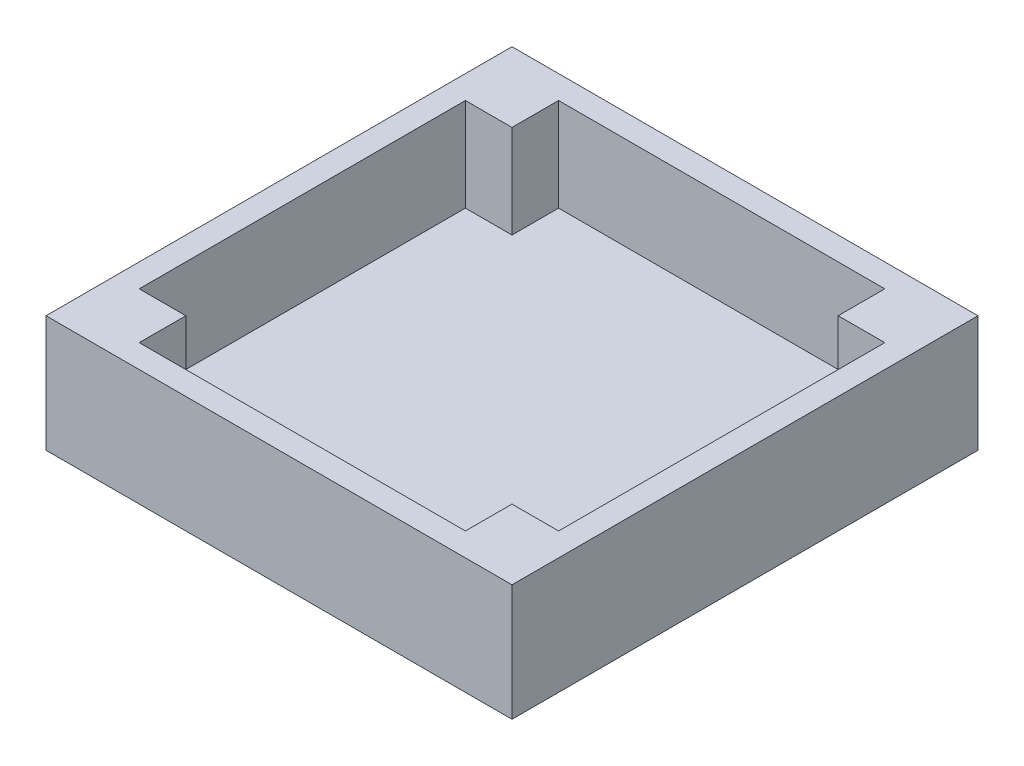
ISO-10303-21;
HEADER;
FILE_DESCRIPTION(('STEP AP214'),'2;1');
FILE_NAME('part.step','',(''),(''),'','','');
FILE_SCHEMA(('AUTOMOTIVE_DESIGN { 1 0 10303 214 1 1 1 1 }'));
ENDSEC;
DATA;
#1=APPLICATION_CONTEXT('core data for automotive mechanical design processes');
#2=APPLICATION_PROTOCOL_DEFINITION('international standard','automotive_design',2000,#1);
#3=PRODUCT_CONTEXT('',#1,'mechanical');
#4=PRODUCT('Part','Part','',(#3));
#5=PRODUCT_RELATED_PRODUCT_CATEGORY('part','',(#4));
#6=PRODUCT_DEFINITION_FORMATION('','',#4);
#7=PRODUCT_DEFINITION_CONTEXT('part definition',#1,'design');
#8=PRODUCT_DEFINITION('design','',#6,#7);
#9=PRODUCT_DEFINITION_SHAPE('','',#8);
#10=(LENGTH_UNIT() NAMED_UNIT(*) SI_UNIT(.MILLI.,.METRE.));
#11=(NAMED_UNIT(*) PLANE_ANGLE_UNIT() SI_UNIT($,.RADIAN.));
#12=(NAMED_UNIT(*) SI_UNIT($,.STERADIAN.) SOLID_ANGLE_UNIT());
#13=UNCERTAINTY_MEASURE_WITH_UNIT(LENGTH_MEASURE(1.E-05),#10,'distance_accuracy_value','');
#14=(GEOMETRIC_REPRESENTATION_CONTEXT(3) GLOBAL_UNCERTAINTY_ASSIGNED_CONTEXT((#13)) GLOBAL_UNIT_ASSIGNED_CONTEXT((#10,
#11,#12)) REPRESENTATION_CONTEXT('',''));
#15=CARTESIAN_POINT('',(0.,0.,0.));
#16=DIRECTION('',(0.,0.,1.));
#17=DIRECTION('',(1.,0.,0.));
#18=AXIS2_PLACEMENT_3D('',#15,#16,#17);
#19=CARTESIAN_POINT('',(0.,3.,0.));
#20=DIRECTION('',(0.,-1.,0.));
#21=DIRECTION('',(0.,0.,-1.));
#22=AXIS2_PLACEMENT_3D('',#19,#20,#21);
#23=PLANE('',#22);
#24=DIRECTION('',(-1.,0.,0.));
#25=VECTOR('',#24,1.);
#26=CARTESIAN_POINT('',(21.,3.,21.));
#27=LINE('',#26,#25);
#28=CARTESIAN_POINT('',(27.,3.,21.));
#29=VERTEX_POINT('',#28);
#30=CARTESIAN_POINT('',(21.,3.,21.));
#31=VERTEX_POINT('',#30);
#32=EDGE_CURVE('E57',#29,#31,#27,.T.);
#33=ORIENTED_EDGE('',*,*,#32,.F.);
#34=DIRECTION('',(0.,0.,-1.));
#35=VECTOR('',#34,1.);
#36=CARTESIAN_POINT('',(27.,3.,0.));
#37=LINE('',#36,#35);
#38=CARTESIAN_POINT('',(27.,3.,-21.));
#39=VERTEX_POINT('',#38);
#40=EDGE_CURVE('E225',#29,#39,#37,.T.);
#41=ORIENTED_EDGE('',*,*,#40,.T.);
#42=DIRECTION('',(1.,0.,0.));
#43=VECTOR('',#42,1.);
#44=CARTESIAN_POINT('',(21.,3.,-21.));
#45=LINE('',#44,#43);
#46=CARTESIAN_POINT('',(21.,3.,-21.));
#47=VERTEX_POINT('',#46);
#48=EDGE_CURVE('E187',#47,#39,#45,.T.);
#49=ORIENTED_EDGE('',*,*,#48,.F.);
#50=DIRECTION('',(0.,0.,1.));
#51=VECTOR('',#50,1.);
#52=CARTESIAN_POINT('',(21.,3.,-27.));
#53=LINE('',#52,#51);
#54=CARTESIAN_POINT('',(21.,3.,-27.));
#55=VERTEX_POINT('',#54);
#56=EDGE_CURVE('E167',#55,#47,#53,.T.);
#57=ORIENTED_EDGE('',*,*,#56,.F.);
#58=DIRECTION('',(-1.,0.,0.));
#59=VECTOR('',#58,1.);
#60=CARTESIAN_POINT('',(0.,3.,-27.));
#61=LINE('',#60,#59);
#62=CARTESIAN_POINT('',(-21.,3.,-27.));
#63=VERTEX_POINT('',#62);
#64=EDGE_CURVE('E240',#55,#63,#61,.T.);
#65=ORIENTED_EDGE('',*,*,#64,.T.);
#66=DIRECTION('',(0.,0.,-1.));
#67=VECTOR('',#66,1.);
#68=CARTESIAN_POINT('',(-21.,3.,-27.));
#69=LINE('',#68,#67);
#70=CARTESIAN_POINT('',(-21.,3.,-21.));
#71=VERTEX_POINT('',#70);
#72=EDGE_CURVE('E228',#71,#63,#69,.T.);
#73=ORIENTED_EDGE('',*,*,#72,.F.);
#74=DIRECTION('',(1.,0.,0.));
#75=VECTOR('',#74,1.);
#76=CARTESIAN_POINT('',(-27.,3.,-21.));
#77=LINE('',#76,#75);
#78=CARTESIAN_POINT('',(-27.,3.,-21.));
#79=VERTEX_POINT('',#78);
#80=EDGE_CURVE('E201',#79,#71,#77,.T.);
#81=ORIENTED_EDGE('',*,*,#80,.F.);
#82=DIRECTION('',(0.,0.,1.));
#83=VECTOR('',#82,1.);
#84=CARTESIAN_POINT('',(-27.,3.,0.));
#85=LINE('',#84,#83);
#86=CARTESIAN_POINT('',(-27.,3.,21.));
#87=VERTEX_POINT('',#86);
#88=EDGE_CURVE('E242',#79,#87,#85,.T.);
#89=ORIENTED_EDGE('',*,*,#88,.T.);
#90=DIRECTION('',(-1.,0.,0.));
#91=VECTOR('',#90,1.);
#92=CARTESIAN_POINT('',(-27.,3.,21.));
#93=LINE('',#92,#91);
#94=CARTESIAN_POINT('',(-21.,3.,21.));
#95=VERTEX_POINT('',#94);
#96=EDGE_CURVE('E205',#95,#87,#93,.T.);
#97=ORIENTED_EDGE('',*,*,#96,.F.);
#98=DIRECTION('',(0.,0.,-1.));
#99=VECTOR('',#98,1.);
#100=CARTESIAN_POINT('',(-21.,3.,21.));
#101=LINE('',#100,#99);
#102=CARTESIAN_POINT('',(-21.,3.,27.));
#103=VERTEX_POINT('',#102);
#104=EDGE_CURVE('E184',#103,#95,#101,.T.);
#105=ORIENTED_EDGE('',*,*,#104,.F.);
#106=DIRECTION('',(1.,0.,0.));
#107=VECTOR('',#106,1.);
#108=CARTESIAN_POINT('',(0.,3.,27.));
#109=LINE('',#108,#107);
#110=CARTESIAN_POINT('',(21.,3.,27.));
#111=VERTEX_POINT('',#110);
#112=EDGE_CURVE('E245',#103,#111,#109,.T.);
#113=ORIENTED_EDGE('',*,*,#112,.T.);
#114=DIRECTION('',(0.,0.,1.));
#115=VECTOR('',#114,1.);
#116=CARTESIAN_POINT('',(21.,3.,21.));
#117=LINE('',#116,#115);
#118=EDGE_CURVE('E52',#31,#111,#117,.T.);
#119=ORIENTED_EDGE('',*,*,#118,.F.);
#120=EDGE_LOOP('',(#33,#41,#49,#57,#65,#73,#81,#89,#97,#105,#113,#119));
#121=FACE_BOUND('',#120,.T.);
#122=ADVANCED_FACE('F37',(#121),#23,.F.);
#123=CARTESIAN_POINT('',(27.,15.,30.));
#124=DIRECTION('',(-1.,0.,0.));
#125=DIRECTION('',(0.,0.,1.));
#126=AXIS2_PLACEMENT_3D('',#123,#124,#125);
#127=PLANE('',#126);
#128=ORIENTED_EDGE('',*,*,#40,.F.);
#129=DIRECTION('',(0.,-1.,0.));
#130=VECTOR('',#129,1.);
#131=CARTESIAN_POINT('',(27.,23.4852813742386,21.));
#132=LINE('',#131,#130);
#133=CARTESIAN_POINT('',(27.,15.,21.));
#134=VERTEX_POINT('',#133);
#135=EDGE_CURVE('E170',#134,#29,#132,.T.);
#136=ORIENTED_EDGE('',*,*,#135,.F.);
#137=DIRECTION('',(0.,0.,-1.));
#138=VECTOR('',#137,1.);
#139=CARTESIAN_POINT('',(27.,15.,0.));
#140=LINE('',#139,#138);
#141=CARTESIAN_POINT('',(27.,15.,-21.));
#142=VERTEX_POINT('',#141);
#143=EDGE_CURVE('E158',#134,#142,#140,.T.);
#144=ORIENTED_EDGE('',*,*,#143,.T.);
#145=DIRECTION('',(0.,-1.,0.));
#146=VECTOR('',#145,1.);
#147=CARTESIAN_POINT('',(27.,23.4852813742386,-21.));
#148=LINE('',#147,#146);
#149=EDGE_CURVE('E193',#142,#39,#148,.T.);
#150=ORIENTED_EDGE('',*,*,#149,.T.);
#151=EDGE_LOOP('',(#128,#136,#144,#150));
#152=FACE_BOUND('',#151,.T.);
#153=ADVANCED_FACE('F304',(#152),#127,.T.);
#154=CARTESIAN_POINT('',(-30.,15.,27.));
#155=DIRECTION('',(0.,0.,-1.));
#156=DIRECTION('',(-1.,0.,0.));
#157=AXIS2_PLACEMENT_3D('',#154,#155,#156);
#158=PLANE('',#157);
#159=DIRECTION('',(1.,0.,0.));
#160=VECTOR('',#159,1.);
#161=CARTESIAN_POINT('',(0.,15.,27.));
#162=LINE('',#161,#160);
#163=CARTESIAN_POINT('',(-21.,15.,27.));
#164=VERTEX_POINT('',#163);
#165=CARTESIAN_POINT('',(21.,15.,27.));
#166=VERTEX_POINT('',#165);
#167=EDGE_CURVE('E252',#164,#166,#162,.T.);
#168=ORIENTED_EDGE('',*,*,#167,.T.);
#169=DIRECTION('',(0.,-1.,0.));
#170=VECTOR('',#169,1.);
#171=CARTESIAN_POINT('',(21.,23.4852813742386,27.));
#172=LINE('',#171,#170);
#173=EDGE_CURVE('E162',#166,#111,#172,.T.);
#174=ORIENTED_EDGE('',*,*,#173,.T.);
#175=ORIENTED_EDGE('',*,*,#112,.F.);
#176=DIRECTION('',(0.,-1.,0.));
#177=VECTOR('',#176,1.);
#178=CARTESIAN_POINT('',(-21.,23.4852813742386,27.));
#179=LINE('',#178,#177);
#180=EDGE_CURVE('E213',#164,#103,#179,.T.);
#181=ORIENTED_EDGE('',*,*,#180,.F.);
#182=EDGE_LOOP('',(#168,#174,#175,#181));
#183=FACE_BOUND('',#182,.T.);
#184=ADVANCED_FACE('F309',(#183),#158,.T.);
#185=CARTESIAN_POINT('',(-30.,15.,-27.));
#186=DIRECTION('',(0.,0.,1.));
#187=DIRECTION('',(1.,0.,0.));
#188=AXIS2_PLACEMENT_3D('',#185,#186,#187);
#189=PLANE('',#188);
#190=ORIENTED_EDGE('',*,*,#64,.F.);
#191=DIRECTION('',(0.,-1.,0.));
#192=VECTOR('',#191,1.);
#193=CARTESIAN_POINT('',(21.,23.4852813742386,-27.));
#194=LINE('',#193,#192);
#195=CARTESIAN_POINT('',(21.,15.,-27.));
#196=VERTEX_POINT('',#195);
#197=EDGE_CURVE('E190',#196,#55,#194,.T.);
#198=ORIENTED_EDGE('',*,*,#197,.F.);
#199=DIRECTION('',(-1.,0.,0.));
#200=VECTOR('',#199,1.);
#201=CARTESIAN_POINT('',(0.,15.,-27.));
#202=LINE('',#201,#200);
#203=CARTESIAN_POINT('',(-21.,15.,-27.));
#204=VERTEX_POINT('',#203);
#205=EDGE_CURVE('E248',#196,#204,#202,.T.);
#206=ORIENTED_EDGE('',*,*,#205,.T.);
#207=DIRECTION('',(0.,-1.,0.));
#208=VECTOR('',#207,1.);
#209=CARTESIAN_POINT('',(-21.,23.4852813742386,-27.));
#210=LINE('',#209,#208);
#211=EDGE_CURVE('E231',#204,#63,#210,.T.);
#212=ORIENTED_EDGE('',*,*,#211,.T.);
#213=EDGE_LOOP('',(#190,#198,#206,#212));
#214=FACE_BOUND('',#213,.T.);
#215=ADVANCED_FACE('F428',(#214),#189,.T.);
#216=CARTESIAN_POINT('',(-27.,15.,30.));
#217=DIRECTION('',(1.,0.,0.));
#218=DIRECTION('',(0.,0.,-1.));
#219=AXIS2_PLACEMENT_3D('',#216,#217,#218);
#220=PLANE('',#219);
#221=DIRECTION('',(0.,0.,1.));
#222=VECTOR('',#221,1.);
#223=CARTESIAN_POINT('',(-27.,15.,0.));
#224=LINE('',#223,#222);
#225=CARTESIAN_POINT('',(-27.,15.,-21.));
#226=VERTEX_POINT('',#225);
#227=CARTESIAN_POINT('',(-27.,15.,21.));
#228=VERTEX_POINT('',#227);
#229=EDGE_CURVE('E250',#226,#228,#224,.T.);
#230=ORIENTED_EDGE('',*,*,#229,.T.);
#231=DIRECTION('',(0.,-1.,0.));
#232=VECTOR('',#231,1.);
#233=CARTESIAN_POINT('',(-27.,23.4852813742386,21.));
#234=LINE('',#233,#232);
#235=EDGE_CURVE('E208',#228,#87,#234,.T.);
#236=ORIENTED_EDGE('',*,*,#235,.T.);
#237=ORIENTED_EDGE('',*,*,#88,.F.);
#238=DIRECTION('',(0.,-1.,0.));
#239=VECTOR('',#238,1.);
#240=CARTESIAN_POINT('',(-27.,23.4852813742386,-21.));
#241=LINE('',#240,#239);
#242=EDGE_CURVE('E222',#226,#79,#241,.T.);
#243=ORIENTED_EDGE('',*,*,#242,.F.);
#244=EDGE_LOOP('',(#230,#236,#237,#243));
#245=FACE_BOUND('',#244,.T.);
#246=ADVANCED_FACE('F317',(#245),#220,.T.);
#247=CARTESIAN_POINT('',(0.,15.,0.));
#248=DIRECTION('',(0.,-1.,0.));
#249=DIRECTION('',(0.,0.,-1.));
#250=AXIS2_PLACEMENT_3D('',#247,#248,#249);
#251=PLANE('',#250);
#252=ORIENTED_EDGE('',*,*,#143,.F.);
#253=DIRECTION('',(1.,0.,0.));
#254=VECTOR('',#253,1.);
#255=CARTESIAN_POINT('',(21.,15.,21.));
#256=LINE('',#255,#254);
#257=CARTESIAN_POINT('',(21.,15.,21.));
#258=VERTEX_POINT('',#257);
#259=EDGE_CURVE('E151',#258,#134,#256,.T.);
#260=ORIENTED_EDGE('',*,*,#259,.F.);
#261=DIRECTION('',(0.,0.,-1.));
#262=VECTOR('',#261,1.);
#263=CARTESIAN_POINT('',(21.,15.,21.));
#264=LINE('',#263,#262);
#265=EDGE_CURVE('E155',#166,#258,#264,.T.);
#266=ORIENTED_EDGE('',*,*,#265,.F.);
#267=ORIENTED_EDGE('',*,*,#167,.F.);
#268=DIRECTION('',(0.,0.,1.));
#269=VECTOR('',#268,1.);
#270=CARTESIAN_POINT('',(-21.,15.,21.));
#271=LINE('',#270,#269);
#272=CARTESIAN_POINT('',(-21.,15.,21.));
#273=VERTEX_POINT('',#272);
#274=EDGE_CURVE('E198',#273,#164,#271,.T.);
#275=ORIENTED_EDGE('',*,*,#274,.F.);
#276=DIRECTION('',(1.,0.,0.));
#277=VECTOR('',#276,1.);
#278=CARTESIAN_POINT('',(-27.,15.,21.));
#279=LINE('',#278,#277);
#280=EDGE_CURVE('E202',#228,#273,#279,.T.);
#281=ORIENTED_EDGE('',*,*,#280,.F.);
#282=ORIENTED_EDGE('',*,*,#229,.F.);
#283=DIRECTION('',(-1.,0.,0.));
#284=VECTOR('',#283,1.);
#285=CARTESIAN_POINT('',(-27.,15.,-21.));
#286=LINE('',#285,#284);
#287=CARTESIAN_POINT('',(-21.,15.,-21.));
#288=VERTEX_POINT('',#287);
#289=EDGE_CURVE('E221',#288,#226,#286,.T.);
#290=ORIENTED_EDGE('',*,*,#289,.F.);
#291=DIRECTION('',(0.,0.,1.));
#292=VECTOR('',#291,1.);
#293=CARTESIAN_POINT('',(-21.,15.,-27.));
#294=LINE('',#293,#292);
#295=EDGE_CURVE('E218',#204,#288,#294,.T.);
#296=ORIENTED_EDGE('',*,*,#295,.F.);
#297=ORIENTED_EDGE('',*,*,#205,.F.);
#298=DIRECTION('',(0.,0.,-1.));
#299=VECTOR('',#298,1.);
#300=CARTESIAN_POINT('',(21.,15.,-27.));
#301=LINE('',#300,#299);
#302=CARTESIAN_POINT('',(21.,15.,-21.));
#303=VERTEX_POINT('',#302);
#304=EDGE_CURVE('E180',#303,#196,#301,.T.);
#305=ORIENTED_EDGE('',*,*,#304,.F.);
#306=DIRECTION('',(-1.,0.,0.));
#307=VECTOR('',#306,1.);
#308=CARTESIAN_POINT('',(21.,15.,-21.));
#309=LINE('',#308,#307);
#310=EDGE_CURVE('E177',#142,#303,#309,.T.);
#311=ORIENTED_EDGE('',*,*,#310,.F.);
#312=EDGE_LOOP('',(#252,#260,#266,#267,#275,#281,#282,#290,#296,#297,#305,#311));
#313=FACE_BOUND('',#312,.T.);
#314=DIRECTION('',(0.,0.,-1.));
#315=VECTOR('',#314,1.);
#316=CARTESIAN_POINT('',(30.,15.,30.));
#317=LINE('',#316,#315);
#318=CARTESIAN_POINT('',(30.,15.,30.));
#319=VERTEX_POINT('',#318);
#320=CARTESIAN_POINT('',(30.,15.,-30.));
#321=VERTEX_POINT('',#320);
#322=EDGE_CURVE('E255',#319,#321,#317,.T.);
#323=ORIENTED_EDGE('',*,*,#322,.T.);
#324=DIRECTION('',(-1.,0.,0.));
#325=VECTOR('',#324,1.);
#326=CARTESIAN_POINT('',(-30.,15.,-30.));
#327=LINE('',#326,#325);
#328=CARTESIAN_POINT('',(-30.,15.,-30.));
#329=VERTEX_POINT('',#328);
#330=EDGE_CURVE('E258',#321,#329,#327,.T.);
#331=ORIENTED_EDGE('',*,*,#330,.T.);
#332=DIRECTION('',(0.,0.,1.));
#333=VECTOR('',#332,1.);
#334=CARTESIAN_POINT('',(-30.,15.,30.));
#335=LINE('',#334,#333);
#336=CARTESIAN_POINT('',(-30.,15.,30.));
#337=VERTEX_POINT('',#336);
#338=EDGE_CURVE('E261',#329,#337,#335,.T.);
#339=ORIENTED_EDGE('',*,*,#338,.T.);
#340=DIRECTION('',(1.,0.,0.));
#341=VECTOR('',#340,1.);
#342=CARTESIAN_POINT('',(-30.,15.,30.));
#343=LINE('',#342,#341);
#344=EDGE_CURVE('E263',#337,#319,#343,.T.);
#345=ORIENTED_EDGE('',*,*,#344,.T.);
#346=EDGE_LOOP('',(#323,#331,#339,#345));
#347=FACE_BOUND('',#346,.T.);
#348=ADVANCED_FACE('F153',(#313,#347),#251,.F.);
#349=CARTESIAN_POINT('',(30.,15.,30.));
#350=DIRECTION('',(-1.,0.,0.));
#351=DIRECTION('',(0.,0.,1.));
#352=AXIS2_PLACEMENT_3D('',#349,#350,#351);
#353=PLANE('',#352);
#354=DIRECTION('',(0.,0.,-1.));
#355=VECTOR('',#354,1.);
#356=CARTESIAN_POINT('',(30.,0.,30.));
#357=LINE('',#356,#355);
#358=CARTESIAN_POINT('',(30.,0.,30.));
#359=VERTEX_POINT('',#358);
#360=CARTESIAN_POINT('',(30.,0.,-30.));
#361=VERTEX_POINT('',#360);
#362=EDGE_CURVE('E254',#359,#361,#357,.T.);
#363=ORIENTED_EDGE('',*,*,#362,.T.);
#364=DIRECTION('',(0.,-1.,0.));
#365=VECTOR('',#364,1.);
#366=CARTESIAN_POINT('',(30.,15.,-30.));
#367=LINE('',#366,#365);
#368=EDGE_CURVE('E11',#321,#361,#367,.T.);
#369=ORIENTED_EDGE('',*,*,#368,.F.);
#370=ORIENTED_EDGE('',*,*,#322,.F.);
#371=DIRECTION('',(0.,-1.,0.));
#372=VECTOR('',#371,1.);
#373=CARTESIAN_POINT('',(30.,15.,30.));
#374=LINE('',#373,#372);
#375=EDGE_CURVE('E265',#319,#359,#374,.T.);
#376=ORIENTED_EDGE('',*,*,#375,.T.);
#377=EDGE_LOOP('',(#363,#369,#370,#376));
#378=FACE_BOUND('',#377,.T.);
#379=ADVANCED_FACE('F39',(#378),#353,.F.);
#380=CARTESIAN_POINT('',(-30.,15.,-30.));
#381=DIRECTION('',(0.,0.,1.));
#382=DIRECTION('',(1.,0.,0.));
#383=AXIS2_PLACEMENT_3D('',#380,#381,#382);
#384=PLANE('',#383);
#385=DIRECTION('',(-1.,0.,0.));
#386=VECTOR('',#385,1.);
#387=CARTESIAN_POINT('',(-30.,0.,-30.));
#388=LINE('',#387,#386);
#389=CARTESIAN_POINT('',(-30.,0.,-30.));
#390=VERTEX_POINT('',#389);
#391=EDGE_CURVE('E268',#361,#390,#388,.T.);
#392=ORIENTED_EDGE('',*,*,#391,.T.);
#393=DIRECTION('',(0.,-1.,0.));
#394=VECTOR('',#393,1.);
#395=CARTESIAN_POINT('',(-30.,15.,-30.));
#396=LINE('',#395,#394);
#397=EDGE_CURVE('E45',#329,#390,#396,.T.);
#398=ORIENTED_EDGE('',*,*,#397,.F.);
#399=ORIENTED_EDGE('',*,*,#330,.F.);
#400=ORIENTED_EDGE('',*,*,#368,.T.);
#401=EDGE_LOOP('',(#392,#398,#399,#400));
#402=FACE_BOUND('',#401,.T.);
#403=ADVANCED_FACE('F296',(#402),#384,.F.);
#404=CARTESIAN_POINT('',(-30.,15.,30.));
#405=DIRECTION('',(1.,0.,0.));
#406=DIRECTION('',(0.,0.,-1.));
#407=AXIS2_PLACEMENT_3D('',#404,#405,#406);
#408=PLANE('',#407);
#409=DIRECTION('',(0.,0.,1.));
#410=VECTOR('',#409,1.);
#411=CARTESIAN_POINT('',(-30.,0.,30.));
#412=LINE('',#411,#410);
#413=CARTESIAN_POINT('',(-30.,0.,30.));
#414=VERTEX_POINT('',#413);
#415=EDGE_CURVE('E270',#390,#414,#412,.T.);
#416=ORIENTED_EDGE('',*,*,#415,.T.);
#417=DIRECTION('',(0.,-1.,0.));
#418=VECTOR('',#417,1.);
#419=CARTESIAN_POINT('',(-30.,15.,30.));
#420=LINE('',#419,#418);
#421=EDGE_CURVE('E275',#337,#414,#420,.T.);
#422=ORIENTED_EDGE('',*,*,#421,.F.);
#423=ORIENTED_EDGE('',*,*,#338,.F.);
#424=ORIENTED_EDGE('',*,*,#397,.T.);
#425=EDGE_LOOP('',(#416,#422,#423,#424));
#426=FACE_BOUND('',#425,.T.);
#427=ADVANCED_FACE('F282',(#426),#408,.F.);
#428=CARTESIAN_POINT('',(-30.,15.,30.));
#429=DIRECTION('',(0.,0.,-1.));
#430=DIRECTION('',(-1.,0.,0.));
#431=AXIS2_PLACEMENT_3D('',#428,#429,#430);
#432=PLANE('',#431);
#433=DIRECTION('',(1.,0.,0.));
#434=VECTOR('',#433,1.);
#435=CARTESIAN_POINT('',(-30.,0.,30.));
#436=LINE('',#435,#434);
#437=EDGE_CURVE('E259',#414,#359,#436,.T.);
#438=ORIENTED_EDGE('',*,*,#437,.T.);
#439=ORIENTED_EDGE('',*,*,#375,.F.);
#440=ORIENTED_EDGE('',*,*,#344,.F.);
#441=ORIENTED_EDGE('',*,*,#421,.T.);
#442=EDGE_LOOP('',(#438,#439,#440,#441));
#443=FACE_BOUND('',#442,.T.);
#444=ADVANCED_FACE('F291',(#443),#432,.F.);
#445=CARTESIAN_POINT('',(0.,0.,0.));
#446=DIRECTION('',(0.,-1.,0.));
#447=DIRECTION('',(0.,0.,-1.));
#448=AXIS2_PLACEMENT_3D('',#445,#446,#447);
#449=PLANE('',#448);
#450=ORIENTED_EDGE('',*,*,#362,.F.);
#451=ORIENTED_EDGE('',*,*,#437,.F.);
#452=ORIENTED_EDGE('',*,*,#415,.F.);
#453=ORIENTED_EDGE('',*,*,#391,.F.);
#454=EDGE_LOOP('',(#450,#451,#452,#453));
#455=FACE_BOUND('',#454,.T.);
#456=ADVANCED_FACE('F288',(#455),#449,.T.);
#457=CARTESIAN_POINT('',(-21.,23.4852813742386,-27.));
#458=DIRECTION('',(-1.,0.,0.));
#459=DIRECTION('',(0.,0.,1.));
#460=AXIS2_PLACEMENT_3D('',#457,#458,#459);
#461=PLANE('',#460);
#462=ORIENTED_EDGE('',*,*,#211,.F.);
#463=ORIENTED_EDGE('',*,*,#295,.T.);
#464=DIRECTION('',(0.,-1.,0.));
#465=VECTOR('',#464,1.);
#466=CARTESIAN_POINT('',(-21.,23.4852813742386,-21.));
#467=LINE('',#466,#465);
#468=EDGE_CURVE('E234',#288,#71,#467,.T.);
#469=ORIENTED_EDGE('',*,*,#468,.T.);
#470=ORIENTED_EDGE('',*,*,#72,.T.);
#471=EDGE_LOOP('',(#462,#463,#469,#470));
#472=FACE_BOUND('',#471,.T.);
#473=ADVANCED_FACE('F320',(#472),#461,.F.);
#474=CARTESIAN_POINT('',(-27.,23.4852813742386,-21.));
#475=DIRECTION('',(0.,0.,-1.));
#476=DIRECTION('',(-1.,0.,0.));
#477=AXIS2_PLACEMENT_3D('',#474,#475,#476);
#478=PLANE('',#477);
#479=ORIENTED_EDGE('',*,*,#468,.F.);
#480=ORIENTED_EDGE('',*,*,#289,.T.);
#481=ORIENTED_EDGE('',*,*,#242,.T.);
#482=ORIENTED_EDGE('',*,*,#80,.T.);
#483=EDGE_LOOP('',(#479,#480,#481,#482));
#484=FACE_BOUND('',#483,.T.);
#485=ADVANCED_FACE('F336',(#484),#478,.F.);
#486=CARTESIAN_POINT('',(-27.,23.4852813742386,21.));
#487=DIRECTION('',(0.,0.,1.));
#488=DIRECTION('',(1.,0.,0.));
#489=AXIS2_PLACEMENT_3D('',#486,#487,#488);
#490=PLANE('',#489);
#491=ORIENTED_EDGE('',*,*,#235,.F.);
#492=ORIENTED_EDGE('',*,*,#280,.T.);
#493=DIRECTION('',(0.,-1.,0.));
#494=VECTOR('',#493,1.);
#495=CARTESIAN_POINT('',(-21.,23.4852813742386,21.));
#496=LINE('',#495,#494);
#497=EDGE_CURVE('E210',#273,#95,#496,.T.);
#498=ORIENTED_EDGE('',*,*,#497,.T.);
#499=ORIENTED_EDGE('',*,*,#96,.T.);
#500=EDGE_LOOP('',(#491,#492,#498,#499));
#501=FACE_BOUND('',#500,.T.);
#502=ADVANCED_FACE('F344',(#501),#490,.F.);
#503=CARTESIAN_POINT('',(-21.,23.4852813742386,21.));
#504=DIRECTION('',(-1.,0.,0.));
#505=DIRECTION('',(0.,0.,1.));
#506=AXIS2_PLACEMENT_3D('',#503,#504,#505);
#507=PLANE('',#506);
#508=ORIENTED_EDGE('',*,*,#497,.F.);
#509=ORIENTED_EDGE('',*,*,#274,.T.);
#510=ORIENTED_EDGE('',*,*,#180,.T.);
#511=ORIENTED_EDGE('',*,*,#104,.T.);
#512=EDGE_LOOP('',(#508,#509,#510,#511));
#513=FACE_BOUND('',#512,.T.);
#514=ADVANCED_FACE('F352',(#513),#507,.F.);
#515=CARTESIAN_POINT('',(21.,23.4852813742386,-21.));
#516=DIRECTION('',(0.,0.,-1.));
#517=DIRECTION('',(-1.,0.,0.));
#518=AXIS2_PLACEMENT_3D('',#515,#516,#517);
#519=PLANE('',#518);
#520=ORIENTED_EDGE('',*,*,#149,.F.);
#521=ORIENTED_EDGE('',*,*,#310,.T.);
#522=DIRECTION('',(0.,-1.,0.));
#523=VECTOR('',#522,1.);
#524=CARTESIAN_POINT('',(21.,23.4852813742386,-21.));
#525=LINE('',#524,#523);
#526=EDGE_CURVE('E181',#303,#47,#525,.T.);
#527=ORIENTED_EDGE('',*,*,#526,.T.);
#528=ORIENTED_EDGE('',*,*,#48,.T.);
#529=EDGE_LOOP('',(#520,#521,#527,#528));
#530=FACE_BOUND('',#529,.T.);
#531=ADVANCED_FACE('F361',(#530),#519,.F.);
#532=CARTESIAN_POINT('',(21.,23.4852813742386,-27.));
#533=DIRECTION('',(1.,0.,0.));
#534=DIRECTION('',(0.,0.,-1.));
#535=AXIS2_PLACEMENT_3D('',#532,#533,#534);
#536=PLANE('',#535);
#537=ORIENTED_EDGE('',*,*,#526,.F.);
#538=ORIENTED_EDGE('',*,*,#304,.T.);
#539=ORIENTED_EDGE('',*,*,#197,.T.);
#540=ORIENTED_EDGE('',*,*,#56,.T.);
#541=EDGE_LOOP('',(#537,#538,#539,#540));
#542=FACE_BOUND('',#541,.T.);
#543=ADVANCED_FACE('F369',(#542),#536,.F.);
#544=CARTESIAN_POINT('',(21.,23.4852813742386,21.));
#545=DIRECTION('',(0.,0.,1.));
#546=DIRECTION('',(1.,0.,0.));
#547=AXIS2_PLACEMENT_3D('',#544,#545,#546);
#548=PLANE('',#547);
#549=DIRECTION('',(0.,-1.,0.));
#550=VECTOR('',#549,1.);
#551=CARTESIAN_POINT('',(21.,23.4852813742386,21.));
#552=LINE('',#551,#550);
#553=EDGE_CURVE('E166',#258,#31,#552,.T.);
#554=ORIENTED_EDGE('',*,*,#553,.F.);
#555=ORIENTED_EDGE('',*,*,#259,.T.);
#556=ORIENTED_EDGE('',*,*,#135,.T.);
#557=ORIENTED_EDGE('',*,*,#32,.T.);
#558=EDGE_LOOP('',(#554,#555,#556,#557));
#559=FACE_BOUND('',#558,.T.);
#560=ADVANCED_FACE('F169',(#559),#548,.F.);
#561=CARTESIAN_POINT('',(21.,23.4852813742386,21.));
#562=DIRECTION('',(1.,0.,0.));
#563=DIRECTION('',(0.,0.,-1.));
#564=AXIS2_PLACEMENT_3D('',#561,#562,#563);
#565=PLANE('',#564);
#566=ORIENTED_EDGE('',*,*,#173,.F.);
#567=ORIENTED_EDGE('',*,*,#265,.T.);
#568=ORIENTED_EDGE('',*,*,#553,.T.);
#569=ORIENTED_EDGE('',*,*,#118,.T.);
#570=EDGE_LOOP('',(#566,#567,#568,#569));
#571=FACE_BOUND('',#570,.T.);
#572=ADVANCED_FACE('F165',(#571),#565,.F.);
#573=CLOSED_SHELL('',(#122,#153,#184,#215,#246,#348,#379,#403,#427,#444,#456,#473,#485,#502,
#514,#531,#543,#560,#572));
#574=MANIFOLD_SOLID_BREP('B2',#573);
#575=ADVANCED_BREP_SHAPE_REPRESENTATION('',(#18,#574),#14);
#576=SHAPE_DEFINITION_REPRESENTATION(#9,#575);
ENDSEC;
END-ISO-10303-21;
